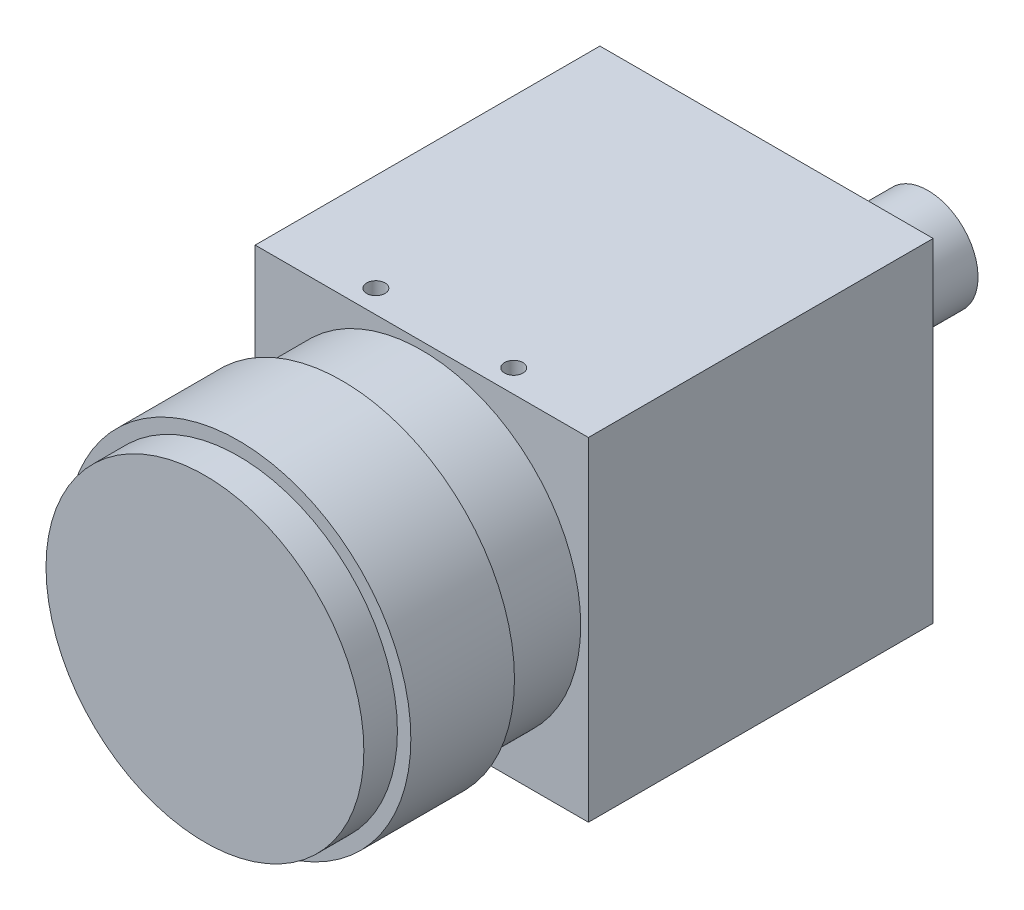
ISO-10303-21;
HEADER;
FILE_DESCRIPTION(('STEP AP214'),'2;1');
FILE_NAME('part.step','',(''),(''),'','','');
FILE_SCHEMA(('AUTOMOTIVE_DESIGN { 1 0 10303 214 1 1 1 1 }'));
ENDSEC;
DATA;
#1=APPLICATION_CONTEXT('core data for automotive mechanical design processes');
#2=APPLICATION_PROTOCOL_DEFINITION('international standard','automotive_design',2000,#1);
#3=PRODUCT_CONTEXT('',#1,'mechanical');
#4=PRODUCT('Part','Part','',(#3));
#5=PRODUCT_RELATED_PRODUCT_CATEGORY('part','',(#4));
#6=PRODUCT_DEFINITION_FORMATION('','',#4);
#7=PRODUCT_DEFINITION_CONTEXT('part definition',#1,'design');
#8=PRODUCT_DEFINITION('design','',#6,#7);
#9=PRODUCT_DEFINITION_SHAPE('','',#8);
#10=(LENGTH_UNIT() NAMED_UNIT(*) SI_UNIT(.MILLI.,.METRE.));
#11=(NAMED_UNIT(*) PLANE_ANGLE_UNIT() SI_UNIT($,.RADIAN.));
#12=(NAMED_UNIT(*) SI_UNIT($,.STERADIAN.) SOLID_ANGLE_UNIT());
#13=UNCERTAINTY_MEASURE_WITH_UNIT(LENGTH_MEASURE(1.E-05),#10,'distance_accuracy_value','');
#14=(GEOMETRIC_REPRESENTATION_CONTEXT(3) GLOBAL_UNCERTAINTY_ASSIGNED_CONTEXT((#13)) GLOBAL_UNIT_ASSIGNED_CONTEXT((#10,
#11,#12)) REPRESENTATION_CONTEXT('',''));
#15=CARTESIAN_POINT('',(0.,0.,0.));
#16=DIRECTION('',(0.,0.,1.));
#17=DIRECTION('',(1.,0.,0.));
#18=AXIS2_PLACEMENT_3D('',#15,#16,#17);
#19=CARTESIAN_POINT('',(14.5,14.5,48.8722));
#20=DIRECTION('',(0.,0.,-1.));
#21=DIRECTION('',(-1.,0.,0.));
#22=AXIS2_PLACEMENT_3D('',#19,#20,#21);
#23=CYLINDRICAL_SURFACE('',#22,13.8303);
#24=CARTESIAN_POINT('',(14.5,14.5,30.));
#25=DIRECTION('',(0.,0.,-1.));
#26=DIRECTION('',(-1.,0.,0.));
#27=AXIS2_PLACEMENT_3D('',#24,#25,#26);
#28=CIRCLE('',#27,13.8303);
#29=CARTESIAN_POINT('',(0.669699999999997,14.5,30.));
#30=VERTEX_POINT('',#29);
#31=EDGE_CURVE('E153',#30,#30,#28,.F.);
#32=ORIENTED_EDGE('',*,*,#31,.T.);
#33=EDGE_LOOP('',(#32));
#34=FACE_BOUND('',#33,.T.);
#35=CARTESIAN_POINT('',(14.5,14.5,36.9342));
#36=DIRECTION('',(0.,0.,1.));
#37=DIRECTION('',(1.,0.,0.));
#38=AXIS2_PLACEMENT_3D('',#35,#36,#37);
#39=CIRCLE('',#38,13.8303);
#40=CARTESIAN_POINT('',(28.3303,14.5,36.9342));
#41=VERTEX_POINT('',#40);
#42=EDGE_CURVE('E11',#41,#41,#39,.T.);
#43=ORIENTED_EDGE('',*,*,#42,.F.);
#44=EDGE_LOOP('',(#43));
#45=FACE_BOUND('',#44,.T.);
#46=ADVANCED_FACE('F34',(#34,#45),#23,.T.);
#47=CARTESIAN_POINT('',(0.,0.,-3.937));
#48=DIRECTION('',(0.,0.,-1.));
#49=DIRECTION('',(-1.,0.,0.));
#50=AXIS2_PLACEMENT_3D('',#47,#48,#49);
#51=PLANE('',#50);
#52=DIRECTION('',(-1.,0.,0.));
#53=VECTOR('',#52,1.);
#54=CARTESIAN_POINT('',(0.,18.034,-3.937));
#55=LINE('',#54,#53);
#56=CARTESIAN_POINT('',(19.5723740241279,18.034,-3.937));
#57=VERTEX_POINT('',#56);
#58=CARTESIAN_POINT('',(5.1308,18.034,-3.937));
#59=VERTEX_POINT('',#58);
#60=EDGE_CURVE('E141',#57,#59,#55,.T.);
#61=ORIENTED_EDGE('',*,*,#60,.F.);
#62=CARTESIAN_POINT('',(22.098,21.5832,-3.937));
#63=DIRECTION('',(0.,0.,-1.));
#64=DIRECTION('',(-1.,0.,0.));
#65=AXIS2_PLACEMENT_3D('',#62,#63,#64);
#66=CIRCLE('',#65,4.3561);
#67=CARTESIAN_POINT('',(22.098,17.2271,-3.937));
#68=VERTEX_POINT('',#67);
#69=EDGE_CURVE('E43',#57,#68,#66,.F.);
#70=ORIENTED_EDGE('',*,*,#69,.T.);
#71=DIRECTION('',(0.,-1.,0.));
#72=VECTOR('',#71,1.);
#73=CARTESIAN_POINT('',(22.098,0.,-3.937));
#74=LINE('',#73,#72);
#75=CARTESIAN_POINT('',(22.098,3.048,-3.937));
#76=VERTEX_POINT('',#75);
#77=EDGE_CURVE('E131',#68,#76,#74,.T.);
#78=ORIENTED_EDGE('',*,*,#77,.T.);
#79=DIRECTION('',(-1.,0.,0.));
#80=VECTOR('',#79,1.);
#81=CARTESIAN_POINT('',(0.,3.048,-3.937));
#82=LINE('',#81,#80);
#83=CARTESIAN_POINT('',(5.13080000000001,3.048,-3.937));
#84=VERTEX_POINT('',#83);
#85=EDGE_CURVE('E140',#76,#84,#82,.T.);
#86=ORIENTED_EDGE('',*,*,#85,.T.);
#87=DIRECTION('',(0.,-1.,0.));
#88=VECTOR('',#87,1.);
#89=CARTESIAN_POINT('',(5.13080000000001,0.,-3.937));
#90=LINE('',#89,#88);
#91=EDGE_CURVE('E253',#59,#84,#90,.T.);
#92=ORIENTED_EDGE('',*,*,#91,.F.);
#93=EDGE_LOOP('',(#61,#70,#78,#86,#92));
#94=FACE_BOUND('',#93,.T.);
#95=ADVANCED_FACE('F150',(#94),#51,.T.);
#96=CARTESIAN_POINT('',(0.,0.,30.));
#97=DIRECTION('',(0.,0.,-1.));
#98=DIRECTION('',(-1.,0.,0.));
#99=AXIS2_PLACEMENT_3D('',#96,#97,#98);
#100=PLANE('',#99);
#101=DIRECTION('',(0.,-1.,0.));
#102=VECTOR('',#101,1.);
#103=CARTESIAN_POINT('',(0.,0.,30.));
#104=LINE('',#103,#102);
#105=CARTESIAN_POINT('',(0.,29.,30.));
#106=VERTEX_POINT('',#105);
#107=CARTESIAN_POINT('',(0.,0.,30.));
#108=VERTEX_POINT('',#107);
#109=EDGE_CURVE('E173',#106,#108,#104,.T.);
#110=ORIENTED_EDGE('',*,*,#109,.T.);
#111=DIRECTION('',(1.,0.,0.));
#112=VECTOR('',#111,1.);
#113=CARTESIAN_POINT('',(0.,0.,30.));
#114=LINE('',#113,#112);
#115=CARTESIAN_POINT('',(29.,0.,30.));
#116=VERTEX_POINT('',#115);
#117=EDGE_CURVE('E185',#108,#116,#114,.T.);
#118=ORIENTED_EDGE('',*,*,#117,.T.);
#119=DIRECTION('',(0.,1.,0.));
#120=VECTOR('',#119,1.);
#121=CARTESIAN_POINT('',(29.,0.,30.));
#122=LINE('',#121,#120);
#123=CARTESIAN_POINT('',(29.,29.,30.));
#124=VERTEX_POINT('',#123);
#125=EDGE_CURVE('E183',#116,#124,#122,.T.);
#126=ORIENTED_EDGE('',*,*,#125,.T.);
#127=DIRECTION('',(-1.,0.,0.));
#128=VECTOR('',#127,1.);
#129=CARTESIAN_POINT('',(0.,29.,30.));
#130=LINE('',#129,#128);
#131=EDGE_CURVE('E170',#124,#106,#130,.T.);
#132=ORIENTED_EDGE('',*,*,#131,.T.);
#133=EDGE_LOOP('',(#110,#118,#126,#132));
#134=FACE_BOUND('',#133,.T.);
#135=ORIENTED_EDGE('',*,*,#31,.F.);
#136=EDGE_LOOP('',(#135));
#137=FACE_BOUND('',#136,.T.);
#138=ADVANCED_FACE('F304',(#134,#137),#100,.F.);
#139=CARTESIAN_POINT('',(0.,0.,30.));
#140=DIRECTION('',(1.,0.,0.));
#141=DIRECTION('',(0.,1.,0.));
#142=AXIS2_PLACEMENT_3D('',#139,#140,#141);
#143=PLANE('',#142);
#144=DIRECTION('',(0.,-1.,0.));
#145=VECTOR('',#144,1.);
#146=CARTESIAN_POINT('',(0.,0.,0.));
#147=LINE('',#146,#145);
#148=CARTESIAN_POINT('',(0.,29.,0.));
#149=VERTEX_POINT('',#148);
#150=CARTESIAN_POINT('',(0.,0.,0.));
#151=VERTEX_POINT('',#150);
#152=EDGE_CURVE('E178',#149,#151,#147,.T.);
#153=ORIENTED_EDGE('',*,*,#152,.T.);
#154=DIRECTION('',(0.,0.,-1.));
#155=VECTOR('',#154,1.);
#156=CARTESIAN_POINT('',(0.,0.,30.));
#157=LINE('',#156,#155);
#158=EDGE_CURVE('E156',#108,#151,#157,.T.);
#159=ORIENTED_EDGE('',*,*,#158,.F.);
#160=ORIENTED_EDGE('',*,*,#109,.F.);
#161=DIRECTION('',(0.,0.,-1.));
#162=VECTOR('',#161,1.);
#163=CARTESIAN_POINT('',(0.,29.,30.));
#164=LINE('',#163,#162);
#165=EDGE_CURVE('E167',#106,#149,#164,.T.);
#166=ORIENTED_EDGE('',*,*,#165,.T.);
#167=EDGE_LOOP('',(#153,#159,#160,#166));
#168=FACE_BOUND('',#167,.T.);
#169=ADVANCED_FACE('F36',(#168),#143,.F.);
#170=CARTESIAN_POINT('',(0.,0.,30.));
#171=DIRECTION('',(0.,1.,0.));
#172=DIRECTION('',(0.,0.,1.));
#173=AXIS2_PLACEMENT_3D('',#170,#171,#172);
#174=PLANE('',#173);
#175=CARTESIAN_POINT('',(14.5,0.,3.5));
#176=DIRECTION('',(0.,-1.,0.));
#177=DIRECTION('',(0.,0.,-1.));
#178=AXIS2_PLACEMENT_3D('',#175,#176,#177);
#179=CIRCLE('',#178,1.25);
#180=CARTESIAN_POINT('',(14.5,0.,2.25000000000001));
#181=VERTEX_POINT('',#180);
#182=EDGE_CURVE('E242',#181,#181,#179,.T.);
#183=ORIENTED_EDGE('',*,*,#182,.F.);
#184=EDGE_LOOP('',(#183));
#185=FACE_BOUND('',#184,.T.);
#186=CARTESIAN_POINT('',(4.5,0.,27.));
#187=DIRECTION('',(0.,-1.,0.));
#188=DIRECTION('',(0.,0.,-1.));
#189=AXIS2_PLACEMENT_3D('',#186,#187,#188);
#190=CIRCLE('',#189,1.25);
#191=CARTESIAN_POINT('',(4.5,0.,25.75));
#192=VERTEX_POINT('',#191);
#193=EDGE_CURVE('E236',#192,#192,#190,.T.);
#194=ORIENTED_EDGE('',*,*,#193,.F.);
#195=EDGE_LOOP('',(#194));
#196=FACE_BOUND('',#195,.T.);
#197=CARTESIAN_POINT('',(24.5,0.,27.));
#198=DIRECTION('',(0.,-1.,0.));
#199=DIRECTION('',(0.,0.,-1.));
#200=AXIS2_PLACEMENT_3D('',#197,#198,#199);
#201=CIRCLE('',#200,1.25);
#202=CARTESIAN_POINT('',(24.5,0.,25.75));
#203=VERTEX_POINT('',#202);
#204=EDGE_CURVE('E230',#203,#203,#201,.T.);
#205=ORIENTED_EDGE('',*,*,#204,.F.);
#206=EDGE_LOOP('',(#205));
#207=FACE_BOUND('',#206,.T.);
#208=CARTESIAN_POINT('',(20.5,0.,3.5));
#209=DIRECTION('',(0.,-1.,0.));
#210=DIRECTION('',(0.,0.,-1.));
#211=AXIS2_PLACEMENT_3D('',#208,#209,#210);
#212=CIRCLE('',#211,0.799999999999988);
#213=CARTESIAN_POINT('',(20.5,0.,2.70000000000001));
#214=VERTEX_POINT('',#213);
#215=EDGE_CURVE('E212',#214,#214,#212,.T.);
#216=ORIENTED_EDGE('',*,*,#215,.F.);
#217=EDGE_LOOP('',(#216));
#218=FACE_BOUND('',#217,.T.);
#219=CARTESIAN_POINT('',(20.5,0.,25.5));
#220=DIRECTION('',(0.,-1.,0.));
#221=DIRECTION('',(0.,0.,-1.));
#222=AXIS2_PLACEMENT_3D('',#219,#220,#221);
#223=CIRCLE('',#222,0.799999999999988);
#224=CARTESIAN_POINT('',(20.5,0.,24.7));
#225=VERTEX_POINT('',#224);
#226=EDGE_CURVE('E206',#225,#225,#223,.T.);
#227=ORIENTED_EDGE('',*,*,#226,.F.);
#228=EDGE_LOOP('',(#227));
#229=FACE_BOUND('',#228,.T.);
#230=CARTESIAN_POINT('',(8.5,0.,3.50000000000002));
#231=DIRECTION('',(0.,-1.,0.));
#232=DIRECTION('',(0.,0.,-1.));
#233=AXIS2_PLACEMENT_3D('',#230,#231,#232);
#234=CIRCLE('',#233,0.79999999999999);
#235=CARTESIAN_POINT('',(8.5,0.,2.70000000000003));
#236=VERTEX_POINT('',#235);
#237=EDGE_CURVE('E200',#236,#236,#234,.T.);
#238=ORIENTED_EDGE('',*,*,#237,.F.);
#239=EDGE_LOOP('',(#238));
#240=FACE_BOUND('',#239,.T.);
#241=CARTESIAN_POINT('',(8.5,0.,25.5));
#242=DIRECTION('',(0.,-1.,0.));
#243=DIRECTION('',(0.,0.,-1.));
#244=AXIS2_PLACEMENT_3D('',#241,#242,#243);
#245=CIRCLE('',#244,0.79999999999999);
#246=CARTESIAN_POINT('',(8.5,0.,24.7));
#247=VERTEX_POINT('',#246);
#248=EDGE_CURVE('E194',#247,#247,#245,.T.);
#249=ORIENTED_EDGE('',*,*,#248,.F.);
#250=EDGE_LOOP('',(#249));
#251=FACE_BOUND('',#250,.T.);
#252=DIRECTION('',(1.,0.,0.));
#253=VECTOR('',#252,1.);
#254=CARTESIAN_POINT('',(0.,0.,0.));
#255=LINE('',#254,#253);
#256=CARTESIAN_POINT('',(29.,0.,0.));
#257=VERTEX_POINT('',#256);
#258=EDGE_CURVE('E176',#151,#257,#255,.T.);
#259=ORIENTED_EDGE('',*,*,#258,.T.);
#260=DIRECTION('',(0.,0.,-1.));
#261=VECTOR('',#260,1.);
#262=CARTESIAN_POINT('',(29.,0.,30.));
#263=LINE('',#262,#261);
#264=EDGE_CURVE('E161',#116,#257,#263,.T.);
#265=ORIENTED_EDGE('',*,*,#264,.F.);
#266=ORIENTED_EDGE('',*,*,#117,.F.);
#267=ORIENTED_EDGE('',*,*,#158,.T.);
#268=EDGE_LOOP('',(#259,#265,#266,#267));
#269=FACE_BOUND('',#268,.T.);
#270=ADVANCED_FACE('F432',(#185,#196,#207,#218,#229,#240,#251,#269),#174,.F.);
#271=CARTESIAN_POINT('',(29.,0.,30.));
#272=DIRECTION('',(-1.,0.,0.));
#273=DIRECTION('',(0.,-1.,0.));
#274=AXIS2_PLACEMENT_3D('',#271,#272,#273);
#275=PLANE('',#274);
#276=DIRECTION('',(0.,1.,0.));
#277=VECTOR('',#276,1.);
#278=CARTESIAN_POINT('',(29.,0.,0.));
#279=LINE('',#278,#277);
#280=CARTESIAN_POINT('',(29.,29.,0.));
#281=VERTEX_POINT('',#280);
#282=EDGE_CURVE('E174',#257,#281,#279,.T.);
#283=ORIENTED_EDGE('',*,*,#282,.T.);
#284=DIRECTION('',(0.,0.,-1.));
#285=VECTOR('',#284,1.);
#286=CARTESIAN_POINT('',(29.,29.,30.));
#287=LINE('',#286,#285);
#288=EDGE_CURVE('E164',#124,#281,#287,.T.);
#289=ORIENTED_EDGE('',*,*,#288,.F.);
#290=ORIENTED_EDGE('',*,*,#125,.F.);
#291=ORIENTED_EDGE('',*,*,#264,.T.);
#292=EDGE_LOOP('',(#283,#289,#290,#291));
#293=FACE_BOUND('',#292,.T.);
#294=ADVANCED_FACE('F429',(#293),#275,.F.);
#295=CARTESIAN_POINT('',(0.,29.,30.));
#296=DIRECTION('',(0.,-1.,0.));
#297=DIRECTION('',(0.,0.,-1.));
#298=AXIS2_PLACEMENT_3D('',#295,#296,#297);
#299=PLANE('',#298);
#300=CARTESIAN_POINT('',(20.5,29.,28.));
#301=DIRECTION('',(0.,1.,0.));
#302=DIRECTION('',(0.,0.,1.));
#303=AXIS2_PLACEMENT_3D('',#300,#301,#302);
#304=CIRCLE('',#303,0.799999999999988);
#305=CARTESIAN_POINT('',(20.5,29.,28.8));
#306=VERTEX_POINT('',#305);
#307=EDGE_CURVE('E224',#306,#306,#304,.T.);
#308=ORIENTED_EDGE('',*,*,#307,.F.);
#309=EDGE_LOOP('',(#308));
#310=FACE_BOUND('',#309,.T.);
#311=CARTESIAN_POINT('',(8.49999999999999,29.,28.));
#312=DIRECTION('',(0.,1.,0.));
#313=DIRECTION('',(0.,0.,1.));
#314=AXIS2_PLACEMENT_3D('',#311,#312,#313);
#315=CIRCLE('',#314,0.79999999999999);
#316=CARTESIAN_POINT('',(8.49999999999999,29.,28.8));
#317=VERTEX_POINT('',#316);
#318=EDGE_CURVE('E218',#317,#317,#315,.T.);
#319=ORIENTED_EDGE('',*,*,#318,.F.);
#320=EDGE_LOOP('',(#319));
#321=FACE_BOUND('',#320,.T.);
#322=DIRECTION('',(-1.,0.,0.));
#323=VECTOR('',#322,1.);
#324=CARTESIAN_POINT('',(0.,29.,0.));
#325=LINE('',#324,#323);
#326=EDGE_CURVE('E171',#281,#149,#325,.T.);
#327=ORIENTED_EDGE('',*,*,#326,.T.);
#328=ORIENTED_EDGE('',*,*,#165,.F.);
#329=ORIENTED_EDGE('',*,*,#131,.F.);
#330=ORIENTED_EDGE('',*,*,#288,.T.);
#331=EDGE_LOOP('',(#327,#328,#329,#330));
#332=FACE_BOUND('',#331,.T.);
#333=ADVANCED_FACE('F415',(#310,#321,#332),#299,.F.);
#334=CARTESIAN_POINT('',(0.,0.,0.));
#335=DIRECTION('',(0.,0.,-1.));
#336=DIRECTION('',(-1.,0.,0.));
#337=AXIS2_PLACEMENT_3D('',#334,#335,#336);
#338=PLANE('',#337);
#339=DIRECTION('',(-1.,0.,0.));
#340=VECTOR('',#339,1.);
#341=CARTESIAN_POINT('',(0.,18.034,0.));
#342=LINE('',#341,#340);
#343=CARTESIAN_POINT('',(19.5723740241279,18.034,0.));
#344=VERTEX_POINT('',#343);
#345=CARTESIAN_POINT('',(5.1308,18.034,0.));
#346=VERTEX_POINT('',#345);
#347=EDGE_CURVE('E261',#344,#346,#342,.T.);
#348=ORIENTED_EDGE('',*,*,#347,.T.);
#349=DIRECTION('',(0.,-1.,0.));
#350=VECTOR('',#349,1.);
#351=CARTESIAN_POINT('',(5.13080000000001,0.,0.));
#352=LINE('',#351,#350);
#353=CARTESIAN_POINT('',(5.13080000000001,3.048,0.));
#354=VERTEX_POINT('',#353);
#355=EDGE_CURVE('E254',#346,#354,#352,.T.);
#356=ORIENTED_EDGE('',*,*,#355,.T.);
#357=DIRECTION('',(-1.,0.,0.));
#358=VECTOR('',#357,1.);
#359=CARTESIAN_POINT('',(0.,3.048,0.));
#360=LINE('',#359,#358);
#361=CARTESIAN_POINT('',(22.098,3.048,0.));
#362=VERTEX_POINT('',#361);
#363=EDGE_CURVE('E256',#362,#354,#360,.T.);
#364=ORIENTED_EDGE('',*,*,#363,.F.);
#365=DIRECTION('',(0.,-1.,0.));
#366=VECTOR('',#365,1.);
#367=CARTESIAN_POINT('',(22.098,0.,0.));
#368=LINE('',#367,#366);
#369=CARTESIAN_POINT('',(22.098,17.2271,0.));
#370=VERTEX_POINT('',#369);
#371=EDGE_CURVE('E55',#370,#362,#368,.T.);
#372=ORIENTED_EDGE('',*,*,#371,.F.);
#373=CARTESIAN_POINT('',(22.098,21.5832,0.));
#374=DIRECTION('',(0.,0.,-1.));
#375=DIRECTION('',(-1.,0.,0.));
#376=AXIS2_PLACEMENT_3D('',#373,#374,#375);
#377=CIRCLE('',#376,4.3561);
#378=EDGE_CURVE('E50',#344,#370,#377,.T.);
#379=ORIENTED_EDGE('',*,*,#378,.F.);
#380=EDGE_LOOP('',(#348,#356,#364,#372,#379));
#381=FACE_BOUND('',#380,.T.);
#382=ORIENTED_EDGE('',*,*,#152,.F.);
#383=ORIENTED_EDGE('',*,*,#326,.F.);
#384=ORIENTED_EDGE('',*,*,#282,.F.);
#385=ORIENTED_EDGE('',*,*,#258,.F.);
#386=EDGE_LOOP('',(#382,#383,#384,#385));
#387=FACE_BOUND('',#386,.T.);
#388=ADVANCED_FACE('F325',(#381,#387),#338,.T.);
#389=CARTESIAN_POINT('',(8.5,8.31087999999999,25.5));
#390=DIRECTION('',(0.,-1.,0.));
#391=DIRECTION('',(0.,0.,-1.));
#392=AXIS2_PLACEMENT_3D('',#389,#390,#391);
#393=CONICAL_SURFACE('',#392,0.799999999999988,1.02974425867664);
#394=CARTESIAN_POINT('',(8.49999999999999,8.79156849522205,25.5));
#395=VERTEX_POINT('',#394);
#396=VERTEX_LOOP('',#395);
#397=FACE_BOUND('',#396,.T.);
#398=CARTESIAN_POINT('',(8.5,8.31087999999999,25.5));
#399=DIRECTION('',(0.,-1.,0.));
#400=DIRECTION('',(0.,0.,-1.));
#401=AXIS2_PLACEMENT_3D('',#398,#399,#400);
#402=CIRCLE('',#401,0.799999999999988);
#403=CARTESIAN_POINT('',(8.5,8.31087999999999,24.7));
#404=VERTEX_POINT('',#403);
#405=EDGE_CURVE('E191',#404,#404,#402,.T.);
#406=ORIENTED_EDGE('',*,*,#405,.T.);
#407=EDGE_LOOP('',(#406));
#408=FACE_BOUND('',#407,.T.);
#409=ADVANCED_FACE('F321',(#397,#408),#393,.F.);
#410=CARTESIAN_POINT('',(8.5,0.,25.5));
#411=DIRECTION('',(0.,-1.,0.));
#412=DIRECTION('',(0.,0.,-1.));
#413=AXIS2_PLACEMENT_3D('',#410,#411,#412);
#414=CYLINDRICAL_SURFACE('',#413,0.799999999999989);
#415=ORIENTED_EDGE('',*,*,#405,.F.);
#416=EDGE_LOOP('',(#415));
#417=FACE_BOUND('',#416,.T.);
#418=ORIENTED_EDGE('',*,*,#248,.T.);
#419=EDGE_LOOP('',(#418));
#420=FACE_BOUND('',#419,.T.);
#421=ADVANCED_FACE('F324',(#417,#420),#414,.F.);
#422=CARTESIAN_POINT('',(8.5,8.31087999999999,3.50000000000002));
#423=DIRECTION('',(0.,-1.,0.));
#424=DIRECTION('',(0.,0.,-1.));
#425=AXIS2_PLACEMENT_3D('',#422,#423,#424);
#426=CONICAL_SURFACE('',#425,0.799999999999988,1.02974425867664);
#427=CARTESIAN_POINT('',(8.5,8.79156849522205,3.50000000000002));
#428=VERTEX_POINT('',#427);
#429=VERTEX_LOOP('',#428);
#430=FACE_BOUND('',#429,.T.);
#431=CARTESIAN_POINT('',(8.5,8.31087999999999,3.50000000000002));
#432=DIRECTION('',(0.,-1.,0.));
#433=DIRECTION('',(0.,0.,-1.));
#434=AXIS2_PLACEMENT_3D('',#431,#432,#433);
#435=CIRCLE('',#434,0.799999999999988);
#436=CARTESIAN_POINT('',(8.5,8.31087999999999,2.70000000000003));
#437=VERTEX_POINT('',#436);
#438=EDGE_CURVE('E197',#437,#437,#435,.T.);
#439=ORIENTED_EDGE('',*,*,#438,.T.);
#440=EDGE_LOOP('',(#439));
#441=FACE_BOUND('',#440,.T.);
#442=ADVANCED_FACE('F329',(#430,#441),#426,.F.);
#443=CARTESIAN_POINT('',(8.5,0.,3.50000000000002));
#444=DIRECTION('',(0.,-1.,0.));
#445=DIRECTION('',(0.,0.,-1.));
#446=AXIS2_PLACEMENT_3D('',#443,#444,#445);
#447=CYLINDRICAL_SURFACE('',#446,0.799999999999989);
#448=ORIENTED_EDGE('',*,*,#438,.F.);
#449=EDGE_LOOP('',(#448));
#450=FACE_BOUND('',#449,.T.);
#451=ORIENTED_EDGE('',*,*,#237,.T.);
#452=EDGE_LOOP('',(#451));
#453=FACE_BOUND('',#452,.T.);
#454=ADVANCED_FACE('F333',(#450,#453),#447,.F.);
#455=CARTESIAN_POINT('',(20.5,8.31087999999999,25.5));
#456=DIRECTION('',(0.,-1.,0.));
#457=DIRECTION('',(0.,0.,-1.));
#458=AXIS2_PLACEMENT_3D('',#455,#456,#457);
#459=CONICAL_SURFACE('',#458,0.799999999999988,1.02974425867664);
#460=CARTESIAN_POINT('',(20.5,8.79156849522205,25.5));
#461=VERTEX_POINT('',#460);
#462=VERTEX_LOOP('',#461);
#463=FACE_BOUND('',#462,.T.);
#464=CARTESIAN_POINT('',(20.5,8.31087999999999,25.5));
#465=DIRECTION('',(0.,-1.,0.));
#466=DIRECTION('',(0.,0.,-1.));
#467=AXIS2_PLACEMENT_3D('',#464,#465,#466);
#468=CIRCLE('',#467,0.799999999999988);
#469=CARTESIAN_POINT('',(20.5,8.31087999999999,24.7));
#470=VERTEX_POINT('',#469);
#471=EDGE_CURVE('E203',#470,#470,#468,.T.);
#472=ORIENTED_EDGE('',*,*,#471,.T.);
#473=EDGE_LOOP('',(#472));
#474=FACE_BOUND('',#473,.T.);
#475=ADVANCED_FACE('F337',(#463,#474),#459,.F.);
#476=CARTESIAN_POINT('',(20.5,0.,25.5));
#477=DIRECTION('',(0.,-1.,0.));
#478=DIRECTION('',(0.,0.,-1.));
#479=AXIS2_PLACEMENT_3D('',#476,#477,#478);
#480=CYLINDRICAL_SURFACE('',#479,0.799999999999988);
#481=ORIENTED_EDGE('',*,*,#471,.F.);
#482=EDGE_LOOP('',(#481));
#483=FACE_BOUND('',#482,.T.);
#484=ORIENTED_EDGE('',*,*,#226,.T.);
#485=EDGE_LOOP('',(#484));
#486=FACE_BOUND('',#485,.T.);
#487=ADVANCED_FACE('F341',(#483,#486),#480,.F.);
#488=CARTESIAN_POINT('',(20.5,8.31087999999999,3.5));
#489=DIRECTION('',(0.,-1.,0.));
#490=DIRECTION('',(0.,0.,-1.));
#491=AXIS2_PLACEMENT_3D('',#488,#489,#490);
#492=CONICAL_SURFACE('',#491,0.799999999999988,1.02974425867664);
#493=CARTESIAN_POINT('',(20.5,8.79156849522205,3.5));
#494=VERTEX_POINT('',#493);
#495=VERTEX_LOOP('',#494);
#496=FACE_BOUND('',#495,.T.);
#497=CARTESIAN_POINT('',(20.5,8.31087999999999,3.5));
#498=DIRECTION('',(0.,-1.,0.));
#499=DIRECTION('',(0.,0.,-1.));
#500=AXIS2_PLACEMENT_3D('',#497,#498,#499);
#501=CIRCLE('',#500,0.799999999999988);
#502=CARTESIAN_POINT('',(20.5,8.31087999999999,2.70000000000001));
#503=VERTEX_POINT('',#502);
#504=EDGE_CURVE('E209',#503,#503,#501,.T.);
#505=ORIENTED_EDGE('',*,*,#504,.T.);
#506=EDGE_LOOP('',(#505));
#507=FACE_BOUND('',#506,.T.);
#508=ADVANCED_FACE('F345',(#496,#507),#492,.F.);
#509=CARTESIAN_POINT('',(20.5,0.,3.5));
#510=DIRECTION('',(0.,-1.,0.));
#511=DIRECTION('',(0.,0.,-1.));
#512=AXIS2_PLACEMENT_3D('',#509,#510,#511);
#513=CYLINDRICAL_SURFACE('',#512,0.799999999999988);
#514=ORIENTED_EDGE('',*,*,#504,.F.);
#515=EDGE_LOOP('',(#514));
#516=FACE_BOUND('',#515,.T.);
#517=ORIENTED_EDGE('',*,*,#215,.T.);
#518=EDGE_LOOP('',(#517));
#519=FACE_BOUND('',#518,.T.);
#520=ADVANCED_FACE('F349',(#516,#519),#513,.F.);
#521=CARTESIAN_POINT('',(8.49999999999999,20.68912,28.));
#522=DIRECTION('',(0.,1.,0.));
#523=DIRECTION('',(0.,0.,1.));
#524=AXIS2_PLACEMENT_3D('',#521,#522,#523);
#525=CONICAL_SURFACE('',#524,0.799999999999988,1.02974425867664);
#526=CARTESIAN_POINT('',(8.49999999999999,20.2084315047779,28.));
#527=VERTEX_POINT('',#526);
#528=VERTEX_LOOP('',#527);
#529=FACE_BOUND('',#528,.T.);
#530=CARTESIAN_POINT('',(8.49999999999999,20.68912,28.));
#531=DIRECTION('',(0.,1.,0.));
#532=DIRECTION('',(0.,0.,1.));
#533=AXIS2_PLACEMENT_3D('',#530,#531,#532);
#534=CIRCLE('',#533,0.799999999999988);
#535=CARTESIAN_POINT('',(8.49999999999999,20.68912,28.8));
#536=VERTEX_POINT('',#535);
#537=EDGE_CURVE('E215',#536,#536,#534,.T.);
#538=ORIENTED_EDGE('',*,*,#537,.T.);
#539=EDGE_LOOP('',(#538));
#540=FACE_BOUND('',#539,.T.);
#541=ADVANCED_FACE('F353',(#529,#540),#525,.F.);
#542=CARTESIAN_POINT('',(8.49999999999999,29.,28.));
#543=DIRECTION('',(0.,1.,0.));
#544=DIRECTION('',(0.,0.,1.));
#545=AXIS2_PLACEMENT_3D('',#542,#543,#544);
#546=CYLINDRICAL_SURFACE('',#545,0.799999999999989);
#547=ORIENTED_EDGE('',*,*,#537,.F.);
#548=EDGE_LOOP('',(#547));
#549=FACE_BOUND('',#548,.T.);
#550=ORIENTED_EDGE('',*,*,#318,.T.);
#551=EDGE_LOOP('',(#550));
#552=FACE_BOUND('',#551,.T.);
#553=ADVANCED_FACE('F357',(#549,#552),#546,.F.);
#554=CARTESIAN_POINT('',(20.5,20.68912,28.));
#555=DIRECTION('',(0.,1.,0.));
#556=DIRECTION('',(0.,0.,1.));
#557=AXIS2_PLACEMENT_3D('',#554,#555,#556);
#558=CONICAL_SURFACE('',#557,0.799999999999988,1.02974425867664);
#559=CARTESIAN_POINT('',(20.5,20.2084315047779,28.));
#560=VERTEX_POINT('',#559);
#561=VERTEX_LOOP('',#560);
#562=FACE_BOUND('',#561,.T.);
#563=CARTESIAN_POINT('',(20.5,20.68912,28.));
#564=DIRECTION('',(0.,1.,0.));
#565=DIRECTION('',(0.,0.,1.));
#566=AXIS2_PLACEMENT_3D('',#563,#564,#565);
#567=CIRCLE('',#566,0.799999999999988);
#568=CARTESIAN_POINT('',(20.5,20.68912,28.8));
#569=VERTEX_POINT('',#568);
#570=EDGE_CURVE('E221',#569,#569,#567,.T.);
#571=ORIENTED_EDGE('',*,*,#570,.T.);
#572=EDGE_LOOP('',(#571));
#573=FACE_BOUND('',#572,.T.);
#574=ADVANCED_FACE('F361',(#562,#573),#558,.F.);
#575=CARTESIAN_POINT('',(20.5,29.,28.));
#576=DIRECTION('',(0.,1.,0.));
#577=DIRECTION('',(0.,0.,1.));
#578=AXIS2_PLACEMENT_3D('',#575,#576,#577);
#579=CYLINDRICAL_SURFACE('',#578,0.799999999999988);
#580=ORIENTED_EDGE('',*,*,#570,.F.);
#581=EDGE_LOOP('',(#580));
#582=FACE_BOUND('',#581,.T.);
#583=ORIENTED_EDGE('',*,*,#307,.T.);
#584=EDGE_LOOP('',(#583));
#585=FACE_BOUND('',#584,.T.);
#586=ADVANCED_FACE('F365',(#582,#585),#579,.F.);
#587=CARTESIAN_POINT('',(24.5,7.50062,27.));
#588=DIRECTION('',(0.,-1.,0.));
#589=DIRECTION('',(0.,0.,-1.));
#590=AXIS2_PLACEMENT_3D('',#587,#588,#589);
#591=CONICAL_SURFACE('',#590,1.25,1.02974425867665);
#592=CARTESIAN_POINT('',(24.5,8.25169577378445,27.));
#593=VERTEX_POINT('',#592);
#594=VERTEX_LOOP('',#593);
#595=FACE_BOUND('',#594,.T.);
#596=CARTESIAN_POINT('',(24.5,7.50062,27.));
#597=DIRECTION('',(0.,-1.,0.));
#598=DIRECTION('',(0.,0.,-1.));
#599=AXIS2_PLACEMENT_3D('',#596,#597,#598);
#600=CIRCLE('',#599,1.25);
#601=CARTESIAN_POINT('',(24.5,7.50062,25.75));
#602=VERTEX_POINT('',#601);
#603=EDGE_CURVE('E227',#602,#602,#600,.T.);
#604=ORIENTED_EDGE('',*,*,#603,.T.);
#605=EDGE_LOOP('',(#604));
#606=FACE_BOUND('',#605,.T.);
#607=ADVANCED_FACE('F369',(#595,#606),#591,.F.);
#608=CARTESIAN_POINT('',(24.5,0.,27.));
#609=DIRECTION('',(0.,-1.,0.));
#610=DIRECTION('',(0.,0.,-1.));
#611=AXIS2_PLACEMENT_3D('',#608,#609,#610);
#612=CYLINDRICAL_SURFACE('',#611,1.25);
#613=ORIENTED_EDGE('',*,*,#603,.F.);
#614=EDGE_LOOP('',(#613));
#615=FACE_BOUND('',#614,.T.);
#616=ORIENTED_EDGE('',*,*,#204,.T.);
#617=EDGE_LOOP('',(#616));
#618=FACE_BOUND('',#617,.T.);
#619=ADVANCED_FACE('F373',(#615,#618),#612,.F.);
#620=CARTESIAN_POINT('',(4.5,7.50062,27.));
#621=DIRECTION('',(0.,-1.,0.));
#622=DIRECTION('',(0.,0.,-1.));
#623=AXIS2_PLACEMENT_3D('',#620,#621,#622);
#624=CONICAL_SURFACE('',#623,1.25,1.02974425867665);
#625=CARTESIAN_POINT('',(4.5,8.25169577378445,27.));
#626=VERTEX_POINT('',#625);
#627=VERTEX_LOOP('',#626);
#628=FACE_BOUND('',#627,.T.);
#629=CARTESIAN_POINT('',(4.5,7.50062,27.));
#630=DIRECTION('',(0.,-1.,0.));
#631=DIRECTION('',(0.,0.,-1.));
#632=AXIS2_PLACEMENT_3D('',#629,#630,#631);
#633=CIRCLE('',#632,1.25);
#634=CARTESIAN_POINT('',(4.5,7.50062,25.75));
#635=VERTEX_POINT('',#634);
#636=EDGE_CURVE('E233',#635,#635,#633,.T.);
#637=ORIENTED_EDGE('',*,*,#636,.T.);
#638=EDGE_LOOP('',(#637));
#639=FACE_BOUND('',#638,.T.);
#640=ADVANCED_FACE('F377',(#628,#639),#624,.F.);
#641=CARTESIAN_POINT('',(4.5,0.,27.));
#642=DIRECTION('',(0.,-1.,0.));
#643=DIRECTION('',(0.,0.,-1.));
#644=AXIS2_PLACEMENT_3D('',#641,#642,#643);
#645=CYLINDRICAL_SURFACE('',#644,1.25);
#646=ORIENTED_EDGE('',*,*,#636,.F.);
#647=EDGE_LOOP('',(#646));
#648=FACE_BOUND('',#647,.T.);
#649=ORIENTED_EDGE('',*,*,#193,.T.);
#650=EDGE_LOOP('',(#649));
#651=FACE_BOUND('',#650,.T.);
#652=ADVANCED_FACE('F381',(#648,#651),#645,.F.);
#653=CARTESIAN_POINT('',(14.5,7.50062,3.5));
#654=DIRECTION('',(0.,-1.,0.));
#655=DIRECTION('',(0.,0.,-1.));
#656=AXIS2_PLACEMENT_3D('',#653,#654,#655);
#657=CONICAL_SURFACE('',#656,1.25,1.02974425867665);
#658=CARTESIAN_POINT('',(14.5,8.25169577378445,3.5));
#659=VERTEX_POINT('',#658);
#660=VERTEX_LOOP('',#659);
#661=FACE_BOUND('',#660,.T.);
#662=CARTESIAN_POINT('',(14.5,7.50062,3.5));
#663=DIRECTION('',(0.,-1.,0.));
#664=DIRECTION('',(0.,0.,-1.));
#665=AXIS2_PLACEMENT_3D('',#662,#663,#664);
#666=CIRCLE('',#665,1.25);
#667=CARTESIAN_POINT('',(14.5,7.50062,2.25000000000001));
#668=VERTEX_POINT('',#667);
#669=EDGE_CURVE('E239',#668,#668,#666,.T.);
#670=ORIENTED_EDGE('',*,*,#669,.T.);
#671=EDGE_LOOP('',(#670));
#672=FACE_BOUND('',#671,.T.);
#673=ADVANCED_FACE('F385',(#661,#672),#657,.F.);
#674=CARTESIAN_POINT('',(14.5,0.,3.5));
#675=DIRECTION('',(0.,-1.,0.));
#676=DIRECTION('',(0.,0.,-1.));
#677=AXIS2_PLACEMENT_3D('',#674,#675,#676);
#678=CYLINDRICAL_SURFACE('',#677,1.25);
#679=ORIENTED_EDGE('',*,*,#669,.F.);
#680=EDGE_LOOP('',(#679));
#681=FACE_BOUND('',#680,.T.);
#682=ORIENTED_EDGE('',*,*,#182,.T.);
#683=EDGE_LOOP('',(#682));
#684=FACE_BOUND('',#683,.T.);
#685=ADVANCED_FACE('F389',(#681,#684),#678,.F.);
#686=CARTESIAN_POINT('',(0.,18.034,-3.937));
#687=DIRECTION('',(0.,1.,0.));
#688=DIRECTION('',(0.,0.,1.));
#689=AXIS2_PLACEMENT_3D('',#686,#687,#688);
#690=PLANE('',#689);
#691=ORIENTED_EDGE('',*,*,#347,.F.);
#692=DIRECTION('',(0.,0.,1.));
#693=VECTOR('',#692,1.);
#694=CARTESIAN_POINT('',(19.5723740241279,18.034,-3.937));
#695=LINE('',#694,#693);
#696=EDGE_CURVE('E147',#57,#344,#695,.T.);
#697=ORIENTED_EDGE('',*,*,#696,.F.);
#698=ORIENTED_EDGE('',*,*,#60,.T.);
#699=DIRECTION('',(0.,0.,1.));
#700=VECTOR('',#699,1.);
#701=CARTESIAN_POINT('',(5.1308,18.034,-3.937));
#702=LINE('',#701,#700);
#703=EDGE_CURVE('E250',#59,#346,#702,.T.);
#704=ORIENTED_EDGE('',*,*,#703,.T.);
#705=EDGE_LOOP('',(#691,#697,#698,#704));
#706=FACE_BOUND('',#705,.T.);
#707=ADVANCED_FACE('F393',(#706),#690,.T.);
#708=CARTESIAN_POINT('',(22.098,21.5832,-3.937));
#709=DIRECTION('',(0.,0.,1.));
#710=DIRECTION('',(1.,0.,0.));
#711=AXIS2_PLACEMENT_3D('',#708,#709,#710);
#712=CYLINDRICAL_SURFACE('',#711,4.3561);
#713=ORIENTED_EDGE('',*,*,#378,.T.);
#714=DIRECTION('',(0.,0.,1.));
#715=VECTOR('',#714,1.);
#716=CARTESIAN_POINT('',(22.098,17.2271,-3.937));
#717=LINE('',#716,#715);
#718=EDGE_CURVE('E134',#68,#370,#717,.T.);
#719=ORIENTED_EDGE('',*,*,#718,.F.);
#720=ORIENTED_EDGE('',*,*,#69,.F.);
#721=ORIENTED_EDGE('',*,*,#696,.T.);
#722=EDGE_LOOP('',(#713,#719,#720,#721));
#723=FACE_BOUND('',#722,.T.);
#724=CARTESIAN_POINT('',(22.098,21.5832,-6.4516));
#725=DIRECTION('',(0.,0.,-1.));
#726=DIRECTION('',(-1.,0.,0.));
#727=AXIS2_PLACEMENT_3D('',#724,#725,#726);
#728=CIRCLE('',#727,4.3561);
#729=CARTESIAN_POINT('',(17.7419,21.5832,-6.4516));
#730=VERTEX_POINT('',#729);
#731=EDGE_CURVE('E263',#730,#730,#728,.T.);
#732=ORIENTED_EDGE('',*,*,#731,.F.);
#733=EDGE_LOOP('',(#732));
#734=FACE_BOUND('',#733,.T.);
#735=ADVANCED_FACE('F145',(#723,#734),#712,.T.);
#736=CARTESIAN_POINT('',(22.098,0.,-3.937));
#737=DIRECTION('',(-1.,0.,0.));
#738=DIRECTION('',(0.,-1.,0.));
#739=AXIS2_PLACEMENT_3D('',#736,#737,#738);
#740=PLANE('',#739);
#741=ORIENTED_EDGE('',*,*,#371,.T.);
#742=DIRECTION('',(0.,0.,1.));
#743=VECTOR('',#742,1.);
#744=CARTESIAN_POINT('',(22.098,3.048,-3.937));
#745=LINE('',#744,#743);
#746=EDGE_CURVE('E136',#76,#362,#745,.T.);
#747=ORIENTED_EDGE('',*,*,#746,.F.);
#748=ORIENTED_EDGE('',*,*,#77,.F.);
#749=ORIENTED_EDGE('',*,*,#718,.T.);
#750=EDGE_LOOP('',(#741,#747,#748,#749));
#751=FACE_BOUND('',#750,.T.);
#752=ADVANCED_FACE('F133',(#751),#740,.F.);
#753=CARTESIAN_POINT('',(0.,3.048,-3.937));
#754=DIRECTION('',(0.,1.,0.));
#755=DIRECTION('',(-1.,0.,0.));
#756=AXIS2_PLACEMENT_3D('',#753,#754,#755);
#757=PLANE('',#756);
#758=ORIENTED_EDGE('',*,*,#363,.T.);
#759=DIRECTION('',(0.,0.,1.));
#760=VECTOR('',#759,1.);
#761=CARTESIAN_POINT('',(5.13080000000001,3.048,-3.937));
#762=LINE('',#761,#760);
#763=EDGE_CURVE('E247',#84,#354,#762,.T.);
#764=ORIENTED_EDGE('',*,*,#763,.F.);
#765=ORIENTED_EDGE('',*,*,#85,.F.);
#766=ORIENTED_EDGE('',*,*,#746,.T.);
#767=EDGE_LOOP('',(#758,#764,#765,#766));
#768=FACE_BOUND('',#767,.T.);
#769=ADVANCED_FACE('F402',(#768),#757,.F.);
#770=CARTESIAN_POINT('',(5.13080000000001,0.,-3.937));
#771=DIRECTION('',(-1.,0.,0.));
#772=DIRECTION('',(0.,-1.,0.));
#773=AXIS2_PLACEMENT_3D('',#770,#771,#772);
#774=PLANE('',#773);
#775=ORIENTED_EDGE('',*,*,#355,.F.);
#776=ORIENTED_EDGE('',*,*,#703,.F.);
#777=ORIENTED_EDGE('',*,*,#91,.T.);
#778=ORIENTED_EDGE('',*,*,#763,.T.);
#779=EDGE_LOOP('',(#775,#776,#777,#778));
#780=FACE_BOUND('',#779,.T.);
#781=ADVANCED_FACE('F295',(#780),#774,.T.);
#782=CARTESIAN_POINT('',(22.098,21.5832,-6.4516));
#783=DIRECTION('',(0.,0.,-1.));
#784=DIRECTION('',(-1.,0.,0.));
#785=AXIS2_PLACEMENT_3D('',#782,#783,#784);
#786=PLANE('',#785);
#787=ORIENTED_EDGE('',*,*,#731,.T.);
#788=EDGE_LOOP('',(#787));
#789=FACE_BOUND('',#788,.T.);
#790=ADVANCED_FACE('F286',(#789),#786,.T.);
#791=CARTESIAN_POINT('',(14.5,14.5,45.9512));
#792=DIRECTION('',(0.,0.,1.));
#793=DIRECTION('',(1.,0.,0.));
#794=AXIS2_PLACEMENT_3D('',#791,#792,#793);
#795=PLANE('',#794);
#796=CARTESIAN_POINT('',(14.5,14.5,45.9512));
#797=DIRECTION('',(0.,0.,1.));
#798=DIRECTION('',(1.,0.,0.));
#799=AXIS2_PLACEMENT_3D('',#796,#797,#798);
#800=CIRCLE('',#799,14.9987);
#801=CARTESIAN_POINT('',(29.4987,14.5,45.9512));
#802=VERTEX_POINT('',#801);
#803=EDGE_CURVE('E273',#802,#802,#800,.T.);
#804=ORIENTED_EDGE('',*,*,#803,.T.);
#805=EDGE_LOOP('',(#804));
#806=FACE_BOUND('',#805,.T.);
#807=CARTESIAN_POINT('',(14.5,14.5,45.9512));
#808=DIRECTION('',(0.,0.,1.));
#809=DIRECTION('',(1.,0.,0.));
#810=AXIS2_PLACEMENT_3D('',#807,#808,#809);
#811=CIRCLE('',#810,13.8303);
#812=CARTESIAN_POINT('',(28.3303,14.5,45.9512));
#813=VERTEX_POINT('',#812);
#814=EDGE_CURVE('E38',#813,#813,#811,.T.);
#815=ORIENTED_EDGE('',*,*,#814,.F.);
#816=EDGE_LOOP('',(#815));
#817=FACE_BOUND('',#816,.T.);
#818=ADVANCED_FACE('F283',(#806,#817),#795,.T.);
#819=CARTESIAN_POINT('',(14.5,14.5,36.9342));
#820=DIRECTION('',(0.,0.,1.));
#821=DIRECTION('',(1.,0.,0.));
#822=AXIS2_PLACEMENT_3D('',#819,#820,#821);
#823=PLANE('',#822);
#824=CARTESIAN_POINT('',(14.5,14.5,36.9342));
#825=DIRECTION('',(0.,0.,1.));
#826=DIRECTION('',(1.,0.,0.));
#827=AXIS2_PLACEMENT_3D('',#824,#825,#826);
#828=CIRCLE('',#827,14.9987);
#829=CARTESIAN_POINT('',(29.4987,14.5,36.9342));
#830=VERTEX_POINT('',#829);
#831=EDGE_CURVE('E270',#830,#830,#828,.T.);
#832=ORIENTED_EDGE('',*,*,#831,.F.);
#833=EDGE_LOOP('',(#832));
#834=FACE_BOUND('',#833,.T.);
#835=ORIENTED_EDGE('',*,*,#42,.T.);
#836=EDGE_LOOP('',(#835));
#837=FACE_BOUND('',#836,.T.);
#838=ADVANCED_FACE('F285',(#834,#837),#823,.F.);
#839=CARTESIAN_POINT('',(14.5,14.5,45.9512));
#840=DIRECTION('',(0.,0.,-1.));
#841=DIRECTION('',(-1.,0.,0.));
#842=AXIS2_PLACEMENT_3D('',#839,#840,#841);
#843=CYLINDRICAL_SURFACE('',#842,14.9987);
#844=ORIENTED_EDGE('',*,*,#803,.F.);
#845=EDGE_LOOP('',(#844));
#846=FACE_BOUND('',#845,.T.);
#847=ORIENTED_EDGE('',*,*,#831,.T.);
#848=EDGE_LOOP('',(#847));
#849=FACE_BOUND('',#848,.T.);
#850=ADVANCED_FACE('F292',(#846,#849),#843,.T.);
#851=CARTESIAN_POINT('',(14.5,14.5,48.8722));
#852=DIRECTION('',(0.,0.,1.));
#853=DIRECTION('',(1.,0.,0.));
#854=AXIS2_PLACEMENT_3D('',#851,#852,#853);
#855=PLANE('',#854);
#856=CARTESIAN_POINT('',(14.5,14.5,48.8722));
#857=DIRECTION('',(0.,0.,1.));
#858=DIRECTION('',(1.,0.,0.));
#859=AXIS2_PLACEMENT_3D('',#856,#857,#858);
#860=CIRCLE('',#859,13.8303);
#861=CARTESIAN_POINT('',(28.3303,14.5,48.8722));
#862=VERTEX_POINT('',#861);
#863=EDGE_CURVE('E181',#862,#862,#860,.T.);
#864=ORIENTED_EDGE('',*,*,#863,.T.);
#865=EDGE_LOOP('',(#864));
#866=FACE_BOUND('',#865,.T.);
#867=ADVANCED_FACE('F310',(#866),#855,.T.);
#868=ORIENTED_EDGE('',*,*,#814,.T.);
#869=EDGE_LOOP('',(#868));
#870=FACE_BOUND('',#869,.T.);
#871=ORIENTED_EDGE('',*,*,#863,.F.);
#872=EDGE_LOOP('',(#871));
#873=FACE_BOUND('',#872,.T.);
#874=ADVANCED_FACE('F280',(#870,#873),#23,.T.);
#875=CLOSED_SHELL('',(#46,#95,#138,#169,#270,#294,#333,#388,#409,#421,#442,#454,#475,#487,#508,
#520,#541,#553,#574,#586,#607,#619,#640,#652,#673,#685,#707,#735,#752,#769,#781,#790,#818,#838,
#850,#867,#874));
#876=MANIFOLD_SOLID_BREP('B2',#875);
#877=ADVANCED_BREP_SHAPE_REPRESENTATION('',(#18,#876),#14);
#878=SHAPE_DEFINITION_REPRESENTATION(#9,#877);
ENDSEC;
END-ISO-10303-21;
